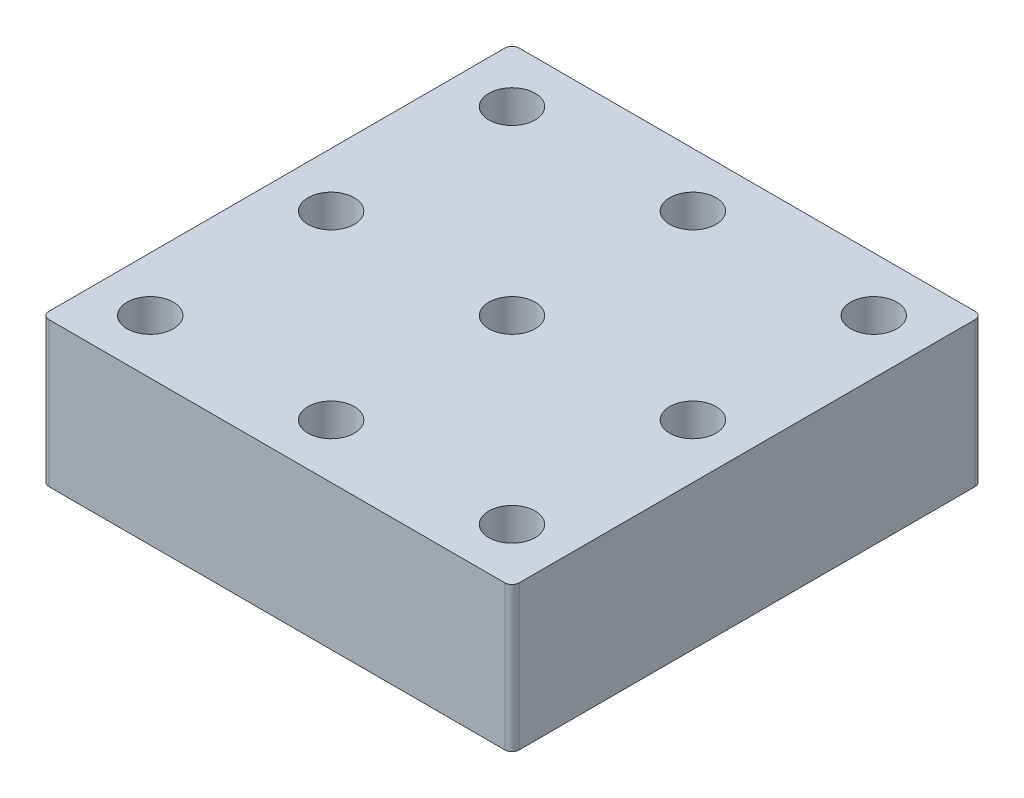
ISO-10303-21;
HEADER;
FILE_DESCRIPTION(('STEP AP214'),'2;1');
FILE_NAME('part.step','',(''),(''),'','','');
FILE_SCHEMA(('AUTOMOTIVE_DESIGN { 1 0 10303 214 1 1 1 1 }'));
ENDSEC;
DATA;
#1=APPLICATION_CONTEXT('core data for automotive mechanical design processes');
#2=APPLICATION_PROTOCOL_DEFINITION('international standard','automotive_design',2000,#1);
#3=PRODUCT_CONTEXT('',#1,'mechanical');
#4=PRODUCT('Part','Part','',(#3));
#5=PRODUCT_RELATED_PRODUCT_CATEGORY('part','',(#4));
#6=PRODUCT_DEFINITION_FORMATION('','',#4);
#7=PRODUCT_DEFINITION_CONTEXT('part definition',#1,'design');
#8=PRODUCT_DEFINITION('design','',#6,#7);
#9=PRODUCT_DEFINITION_SHAPE('','',#8);
#10=(LENGTH_UNIT() NAMED_UNIT(*) SI_UNIT(.MILLI.,.METRE.));
#11=(NAMED_UNIT(*) PLANE_ANGLE_UNIT() SI_UNIT($,.RADIAN.));
#12=(NAMED_UNIT(*) SI_UNIT($,.STERADIAN.) SOLID_ANGLE_UNIT());
#13=UNCERTAINTY_MEASURE_WITH_UNIT(LENGTH_MEASURE(1.E-05),#10,'distance_accuracy_value','');
#14=(GEOMETRIC_REPRESENTATION_CONTEXT(3) GLOBAL_UNCERTAINTY_ASSIGNED_CONTEXT((#13)) GLOBAL_UNIT_ASSIGNED_CONTEXT((#10,
#11,#12)) REPRESENTATION_CONTEXT('',''));
#15=CARTESIAN_POINT('',(0.,0.,0.));
#16=DIRECTION('',(0.,0.,1.));
#17=DIRECTION('',(1.,0.,0.));
#18=AXIS2_PLACEMENT_3D('',#15,#16,#17);
#19=CARTESIAN_POINT('',(-32.5,20.,-32.5));
#20=DIRECTION('',(1.,0.,0.));
#21=DIRECTION('',(0.,0.,-1.));
#22=AXIS2_PLACEMENT_3D('',#19,#20,#21);
#23=PLANE('',#22);
#24=DIRECTION('',(0.,0.,1.));
#25=VECTOR('',#24,1.);
#26=CARTESIAN_POINT('',(-32.5,20.,-32.5));
#27=LINE('',#26,#25);
#28=CARTESIAN_POINT('',(-32.5,20.,-31.5));
#29=VERTEX_POINT('',#28);
#30=CARTESIAN_POINT('',(-32.5,20.,31.5));
#31=VERTEX_POINT('',#30);
#32=EDGE_CURVE('E117',#29,#31,#27,.T.);
#33=ORIENTED_EDGE('',*,*,#32,.F.);
#34=DIRECTION('',(0.,-1.,0.));
#35=VECTOR('',#34,1.);
#36=CARTESIAN_POINT('',(-32.5,20.,-31.5));
#37=LINE('',#36,#35);
#38=CARTESIAN_POINT('',(-32.5,0.,-31.5));
#39=VERTEX_POINT('',#38);
#40=EDGE_CURVE('E102',#29,#39,#37,.T.);
#41=ORIENTED_EDGE('',*,*,#40,.T.);
#42=DIRECTION('',(0.,0.,1.));
#43=VECTOR('',#42,1.);
#44=CARTESIAN_POINT('',(-32.5,0.,-32.5));
#45=LINE('',#44,#43);
#46=CARTESIAN_POINT('',(-32.5,0.,31.5));
#47=VERTEX_POINT('',#46);
#48=EDGE_CURVE('E114',#39,#47,#45,.T.);
#49=ORIENTED_EDGE('',*,*,#48,.T.);
#50=DIRECTION('',(0.,-1.,0.));
#51=VECTOR('',#50,1.);
#52=CARTESIAN_POINT('',(-32.5,20.,31.5));
#53=LINE('',#52,#51);
#54=EDGE_CURVE('E119',#47,#31,#53,.F.);
#55=ORIENTED_EDGE('',*,*,#54,.T.);
#56=EDGE_LOOP('',(#33,#41,#49,#55));
#57=FACE_BOUND('',#56,.T.);
#58=ADVANCED_FACE('F32',(#57),#23,.F.);
#59=CARTESIAN_POINT('',(-32.5,20.,32.5));
#60=DIRECTION('',(0.,0.,-1.));
#61=DIRECTION('',(-1.,0.,0.));
#62=AXIS2_PLACEMENT_3D('',#59,#60,#61);
#63=PLANE('',#62);
#64=DIRECTION('',(1.,0.,0.));
#65=VECTOR('',#64,1.);
#66=CARTESIAN_POINT('',(-32.5,0.,32.5));
#67=LINE('',#66,#65);
#68=CARTESIAN_POINT('',(-31.5,0.,32.5));
#69=VERTEX_POINT('',#68);
#70=CARTESIAN_POINT('',(31.5,0.,32.5));
#71=VERTEX_POINT('',#70);
#72=EDGE_CURVE('E123',#69,#71,#67,.T.);
#73=ORIENTED_EDGE('',*,*,#72,.T.);
#74=DIRECTION('',(0.,-1.,0.));
#75=VECTOR('',#74,1.);
#76=CARTESIAN_POINT('',(31.5,20.,32.5));
#77=LINE('',#76,#75);
#78=CARTESIAN_POINT('',(31.5,20.,32.5));
#79=VERTEX_POINT('',#78);
#80=EDGE_CURVE('E11',#71,#79,#77,.F.);
#81=ORIENTED_EDGE('',*,*,#80,.T.);
#82=DIRECTION('',(1.,0.,0.));
#83=VECTOR('',#82,1.);
#84=CARTESIAN_POINT('',(-32.5,20.,32.5));
#85=LINE('',#84,#83);
#86=CARTESIAN_POINT('',(-31.5,20.,32.5));
#87=VERTEX_POINT('',#86);
#88=EDGE_CURVE('E163',#87,#79,#85,.T.);
#89=ORIENTED_EDGE('',*,*,#88,.F.);
#90=DIRECTION('',(0.,-1.,0.));
#91=VECTOR('',#90,1.);
#92=CARTESIAN_POINT('',(-31.5,20.,32.5));
#93=LINE('',#92,#91);
#94=EDGE_CURVE('E40',#87,#69,#93,.T.);
#95=ORIENTED_EDGE('',*,*,#94,.T.);
#96=EDGE_LOOP('',(#73,#81,#89,#95));
#97=FACE_BOUND('',#96,.T.);
#98=ADVANCED_FACE('F161',(#97),#63,.F.);
#99=CARTESIAN_POINT('',(32.5,20.,-32.5));
#100=DIRECTION('',(-1.,0.,0.));
#101=DIRECTION('',(0.,0.,1.));
#102=AXIS2_PLACEMENT_3D('',#99,#100,#101);
#103=PLANE('',#102);
#104=DIRECTION('',(0.,0.,-1.));
#105=VECTOR('',#104,1.);
#106=CARTESIAN_POINT('',(32.5,0.,-32.5));
#107=LINE('',#106,#105);
#108=CARTESIAN_POINT('',(32.5,0.,31.5));
#109=VERTEX_POINT('',#108);
#110=CARTESIAN_POINT('',(32.5,0.,-31.5));
#111=VERTEX_POINT('',#110);
#112=EDGE_CURVE('E127',#109,#111,#107,.T.);
#113=ORIENTED_EDGE('',*,*,#112,.T.);
#114=DIRECTION('',(0.,-1.,0.));
#115=VECTOR('',#114,1.);
#116=CARTESIAN_POINT('',(32.5,20.,-31.5));
#117=LINE('',#116,#115);
#118=CARTESIAN_POINT('',(32.5,20.,-31.5));
#119=VERTEX_POINT('',#118);
#120=EDGE_CURVE('E47',#111,#119,#117,.F.);
#121=ORIENTED_EDGE('',*,*,#120,.T.);
#122=DIRECTION('',(0.,0.,-1.));
#123=VECTOR('',#122,1.);
#124=CARTESIAN_POINT('',(32.5,20.,-32.5));
#125=LINE('',#124,#123);
#126=CARTESIAN_POINT('',(32.5,20.,31.5));
#127=VERTEX_POINT('',#126);
#128=EDGE_CURVE('E171',#127,#119,#125,.T.);
#129=ORIENTED_EDGE('',*,*,#128,.F.);
#130=DIRECTION('',(0.,-1.,0.));
#131=VECTOR('',#130,1.);
#132=CARTESIAN_POINT('',(32.5,20.,31.5));
#133=LINE('',#132,#131);
#134=EDGE_CURVE('E154',#127,#109,#133,.T.);
#135=ORIENTED_EDGE('',*,*,#134,.T.);
#136=EDGE_LOOP('',(#113,#121,#129,#135));
#137=FACE_BOUND('',#136,.T.);
#138=ADVANCED_FACE('F170',(#137),#103,.F.);
#139=CARTESIAN_POINT('',(-32.5,20.,-32.5));
#140=DIRECTION('',(0.,0.,1.));
#141=DIRECTION('',(1.,0.,0.));
#142=AXIS2_PLACEMENT_3D('',#139,#140,#141);
#143=PLANE('',#142);
#144=DIRECTION('',(-1.,0.,0.));
#145=VECTOR('',#144,1.);
#146=CARTESIAN_POINT('',(-32.5,0.,-32.5));
#147=LINE('',#146,#145);
#148=CARTESIAN_POINT('',(31.5,0.,-32.5));
#149=VERTEX_POINT('',#148);
#150=CARTESIAN_POINT('',(-31.5,0.,-32.5));
#151=VERTEX_POINT('',#150);
#152=EDGE_CURVE('E137',#149,#151,#147,.T.);
#153=ORIENTED_EDGE('',*,*,#152,.T.);
#154=DIRECTION('',(0.,-1.,0.));
#155=VECTOR('',#154,1.);
#156=CARTESIAN_POINT('',(-31.5,20.,-32.5));
#157=LINE('',#156,#155);
#158=CARTESIAN_POINT('',(-31.5,20.,-32.5));
#159=VERTEX_POINT('',#158);
#160=EDGE_CURVE('E103',#151,#159,#157,.F.);
#161=ORIENTED_EDGE('',*,*,#160,.T.);
#162=DIRECTION('',(-1.,0.,0.));
#163=VECTOR('',#162,1.);
#164=CARTESIAN_POINT('',(-32.5,20.,-32.5));
#165=LINE('',#164,#163);
#166=CARTESIAN_POINT('',(31.5,20.,-32.5));
#167=VERTEX_POINT('',#166);
#168=EDGE_CURVE('E133',#167,#159,#165,.T.);
#169=ORIENTED_EDGE('',*,*,#168,.F.);
#170=DIRECTION('',(0.,-1.,0.));
#171=VECTOR('',#170,1.);
#172=CARTESIAN_POINT('',(31.5,20.,-32.5));
#173=LINE('',#172,#171);
#174=EDGE_CURVE('E108',#167,#149,#173,.T.);
#175=ORIENTED_EDGE('',*,*,#174,.T.);
#176=EDGE_LOOP('',(#153,#161,#169,#175));
#177=FACE_BOUND('',#176,.T.);
#178=ADVANCED_FACE('F264',(#177),#143,.F.);
#179=CARTESIAN_POINT('',(0.,20.,0.));
#180=DIRECTION('',(0.,1.,0.));
#181=DIRECTION('',(0.,0.,1.));
#182=AXIS2_PLACEMENT_3D('',#179,#180,#181);
#183=PLANE('',#182);
#184=CARTESIAN_POINT('',(0.,20.,0.));
#185=DIRECTION('',(0.,1.,0.));
#186=DIRECTION('',(0.,0.,1.));
#187=AXIS2_PLACEMENT_3D('',#184,#185,#186);
#188=CIRCLE('',#187,3.2);
#189=CARTESIAN_POINT('',(0.,20.,3.2));
#190=VERTEX_POINT('',#189);
#191=EDGE_CURVE('E228',#190,#190,#188,.T.);
#192=ORIENTED_EDGE('',*,*,#191,.F.);
#193=EDGE_LOOP('',(#192));
#194=FACE_BOUND('',#193,.T.);
#195=CARTESIAN_POINT('',(-25.,20.,0.));
#196=DIRECTION('',(0.,1.,0.));
#197=DIRECTION('',(0.,0.,1.));
#198=AXIS2_PLACEMENT_3D('',#195,#196,#197);
#199=CIRCLE('',#198,3.2);
#200=CARTESIAN_POINT('',(-25.,20.,3.2));
#201=VERTEX_POINT('',#200);
#202=EDGE_CURVE('E234',#201,#201,#199,.T.);
#203=ORIENTED_EDGE('',*,*,#202,.F.);
#204=EDGE_LOOP('',(#203));
#205=FACE_BOUND('',#204,.T.);
#206=CARTESIAN_POINT('',(-25.,20.,25.));
#207=DIRECTION('',(0.,1.,0.));
#208=DIRECTION('',(0.,0.,1.));
#209=AXIS2_PLACEMENT_3D('',#206,#207,#208);
#210=CIRCLE('',#209,3.2);
#211=CARTESIAN_POINT('',(-25.,20.,28.2));
#212=VERTEX_POINT('',#211);
#213=EDGE_CURVE('E240',#212,#212,#210,.T.);
#214=ORIENTED_EDGE('',*,*,#213,.F.);
#215=EDGE_LOOP('',(#214));
#216=FACE_BOUND('',#215,.T.);
#217=CARTESIAN_POINT('',(0.,20.,25.));
#218=DIRECTION('',(0.,1.,0.));
#219=DIRECTION('',(0.,0.,1.));
#220=AXIS2_PLACEMENT_3D('',#217,#218,#219);
#221=CIRCLE('',#220,3.2);
#222=CARTESIAN_POINT('',(0.,20.,28.2));
#223=VERTEX_POINT('',#222);
#224=EDGE_CURVE('E246',#223,#223,#221,.T.);
#225=ORIENTED_EDGE('',*,*,#224,.F.);
#226=EDGE_LOOP('',(#225));
#227=FACE_BOUND('',#226,.T.);
#228=CARTESIAN_POINT('',(25.,20.,25.));
#229=DIRECTION('',(0.,1.,0.));
#230=DIRECTION('',(0.,0.,1.));
#231=AXIS2_PLACEMENT_3D('',#228,#229,#230);
#232=CIRCLE('',#231,3.2);
#233=CARTESIAN_POINT('',(25.,20.,28.2));
#234=VERTEX_POINT('',#233);
#235=EDGE_CURVE('E204',#234,#234,#232,.T.);
#236=ORIENTED_EDGE('',*,*,#235,.F.);
#237=EDGE_LOOP('',(#236));
#238=FACE_BOUND('',#237,.T.);
#239=CARTESIAN_POINT('',(25.,20.,0.));
#240=DIRECTION('',(0.,1.,0.));
#241=DIRECTION('',(0.,0.,1.));
#242=AXIS2_PLACEMENT_3D('',#239,#240,#241);
#243=CIRCLE('',#242,3.2);
#244=CARTESIAN_POINT('',(25.,20.,3.2));
#245=VERTEX_POINT('',#244);
#246=EDGE_CURVE('E211',#245,#245,#243,.T.);
#247=ORIENTED_EDGE('',*,*,#246,.F.);
#248=EDGE_LOOP('',(#247));
#249=FACE_BOUND('',#248,.T.);
#250=CARTESIAN_POINT('',(25.,20.,-25.));
#251=DIRECTION('',(0.,1.,0.));
#252=DIRECTION('',(0.,0.,1.));
#253=AXIS2_PLACEMENT_3D('',#250,#251,#252);
#254=CIRCLE('',#253,3.2);
#255=CARTESIAN_POINT('',(25.,20.,-21.8));
#256=VERTEX_POINT('',#255);
#257=EDGE_CURVE('E217',#256,#256,#254,.T.);
#258=ORIENTED_EDGE('',*,*,#257,.F.);
#259=EDGE_LOOP('',(#258));
#260=FACE_BOUND('',#259,.T.);
#261=CARTESIAN_POINT('',(0.,20.,-25.));
#262=DIRECTION('',(0.,1.,0.));
#263=DIRECTION('',(0.,0.,1.));
#264=AXIS2_PLACEMENT_3D('',#261,#262,#263);
#265=CIRCLE('',#264,3.2);
#266=CARTESIAN_POINT('',(0.,20.,-21.8));
#267=VERTEX_POINT('',#266);
#268=EDGE_CURVE('E223',#267,#267,#265,.T.);
#269=ORIENTED_EDGE('',*,*,#268,.F.);
#270=EDGE_LOOP('',(#269));
#271=FACE_BOUND('',#270,.T.);
#272=CARTESIAN_POINT('',(-25.,20.,-25.));
#273=DIRECTION('',(0.,1.,0.));
#274=DIRECTION('',(0.,0.,1.));
#275=AXIS2_PLACEMENT_3D('',#272,#273,#274);
#276=CIRCLE('',#275,3.2);
#277=CARTESIAN_POINT('',(-25.,20.,-21.8));
#278=VERTEX_POINT('',#277);
#279=EDGE_CURVE('E198',#278,#278,#276,.T.);
#280=ORIENTED_EDGE('',*,*,#279,.F.);
#281=EDGE_LOOP('',(#280));
#282=FACE_BOUND('',#281,.T.);
#283=ORIENTED_EDGE('',*,*,#168,.T.);
#284=CARTESIAN_POINT('',(-31.5,20.,-31.5));
#285=DIRECTION('',(0.,1.,0.));
#286=DIRECTION('',(0.,0.,1.));
#287=AXIS2_PLACEMENT_3D('',#284,#285,#286);
#288=CIRCLE('',#287,1.);
#289=EDGE_CURVE('E152',#159,#29,#288,.T.);
#290=ORIENTED_EDGE('',*,*,#289,.T.);
#291=ORIENTED_EDGE('',*,*,#32,.T.);
#292=CARTESIAN_POINT('',(-31.5,20.,31.5));
#293=DIRECTION('',(0.,1.,0.));
#294=DIRECTION('',(0.,0.,1.));
#295=AXIS2_PLACEMENT_3D('',#292,#293,#294);
#296=CIRCLE('',#295,1.);
#297=EDGE_CURVE('E147',#31,#87,#296,.T.);
#298=ORIENTED_EDGE('',*,*,#297,.T.);
#299=ORIENTED_EDGE('',*,*,#88,.T.);
#300=CARTESIAN_POINT('',(31.5,20.,31.5));
#301=DIRECTION('',(0.,1.,0.));
#302=DIRECTION('',(0.,0.,1.));
#303=AXIS2_PLACEMENT_3D('',#300,#301,#302);
#304=CIRCLE('',#303,1.);
#305=EDGE_CURVE('E54',#79,#127,#304,.T.);
#306=ORIENTED_EDGE('',*,*,#305,.T.);
#307=ORIENTED_EDGE('',*,*,#128,.T.);
#308=CARTESIAN_POINT('',(31.5,20.,-31.5));
#309=DIRECTION('',(0.,1.,0.));
#310=DIRECTION('',(0.,0.,1.));
#311=AXIS2_PLACEMENT_3D('',#308,#309,#310);
#312=CIRCLE('',#311,1.);
#313=EDGE_CURVE('E150',#119,#167,#312,.T.);
#314=ORIENTED_EDGE('',*,*,#313,.T.);
#315=EDGE_LOOP('',(#283,#290,#291,#298,#299,#306,#307,#314));
#316=FACE_BOUND('',#315,.T.);
#317=ADVANCED_FACE('F261',(#194,#205,#216,#227,#238,#249,#260,#271,#282,#316),#183,.T.);
#318=CARTESIAN_POINT('',(0.,0.,0.));
#319=DIRECTION('',(0.,1.,0.));
#320=DIRECTION('',(0.,0.,1.));
#321=AXIS2_PLACEMENT_3D('',#318,#319,#320);
#322=PLANE('',#321);
#323=CARTESIAN_POINT('',(25.,0.,25.));
#324=DIRECTION('',(0.,-1.,0.));
#325=DIRECTION('',(0.,0.,-1.));
#326=AXIS2_PLACEMENT_3D('',#323,#324,#325);
#327=CIRCLE('',#326,3.);
#328=CARTESIAN_POINT('',(25.,0.,22.));
#329=VERTEX_POINT('',#328);
#330=EDGE_CURVE('E193',#329,#329,#327,.T.);
#331=ORIENTED_EDGE('',*,*,#330,.F.);
#332=EDGE_LOOP('',(#331));
#333=FACE_BOUND('',#332,.T.);
#334=CARTESIAN_POINT('',(25.,0.,-25.));
#335=DIRECTION('',(0.,-1.,0.));
#336=DIRECTION('',(0.,0.,-1.));
#337=AXIS2_PLACEMENT_3D('',#334,#335,#336);
#338=CIRCLE('',#337,3.);
#339=CARTESIAN_POINT('',(25.,0.,-28.));
#340=VERTEX_POINT('',#339);
#341=EDGE_CURVE('E187',#340,#340,#338,.T.);
#342=ORIENTED_EDGE('',*,*,#341,.F.);
#343=EDGE_LOOP('',(#342));
#344=FACE_BOUND('',#343,.T.);
#345=CARTESIAN_POINT('',(-25.,0.,-25.));
#346=DIRECTION('',(0.,-1.,0.));
#347=DIRECTION('',(0.,0.,-1.));
#348=AXIS2_PLACEMENT_3D('',#345,#346,#347);
#349=CIRCLE('',#348,3.);
#350=CARTESIAN_POINT('',(-25.,0.,-28.));
#351=VERTEX_POINT('',#350);
#352=EDGE_CURVE('E180',#351,#351,#349,.T.);
#353=ORIENTED_EDGE('',*,*,#352,.F.);
#354=EDGE_LOOP('',(#353));
#355=FACE_BOUND('',#354,.T.);
#356=CARTESIAN_POINT('',(-25.,0.,25.));
#357=DIRECTION('',(0.,-1.,0.));
#358=DIRECTION('',(0.,0.,-1.));
#359=AXIS2_PLACEMENT_3D('',#356,#357,#358);
#360=CIRCLE('',#359,3.);
#361=CARTESIAN_POINT('',(-25.,0.,22.));
#362=VERTEX_POINT('',#361);
#363=EDGE_CURVE('E130',#362,#362,#360,.T.);
#364=ORIENTED_EDGE('',*,*,#363,.F.);
#365=EDGE_LOOP('',(#364));
#366=FACE_BOUND('',#365,.T.);
#367=ORIENTED_EDGE('',*,*,#48,.F.);
#368=CARTESIAN_POINT('',(-31.5,0.,-31.5));
#369=DIRECTION('',(0.,1.,0.));
#370=DIRECTION('',(0.,0.,1.));
#371=AXIS2_PLACEMENT_3D('',#368,#369,#370);
#372=CIRCLE('',#371,1.);
#373=EDGE_CURVE('E98',#39,#151,#372,.F.);
#374=ORIENTED_EDGE('',*,*,#373,.T.);
#375=ORIENTED_EDGE('',*,*,#152,.F.);
#376=CARTESIAN_POINT('',(31.5,0.,-31.5));
#377=DIRECTION('',(0.,1.,0.));
#378=DIRECTION('',(0.,0.,1.));
#379=AXIS2_PLACEMENT_3D('',#376,#377,#378);
#380=CIRCLE('',#379,1.);
#381=EDGE_CURVE('E109',#149,#111,#380,.F.);
#382=ORIENTED_EDGE('',*,*,#381,.T.);
#383=ORIENTED_EDGE('',*,*,#112,.F.);
#384=CARTESIAN_POINT('',(31.5,0.,31.5));
#385=DIRECTION('',(0.,1.,0.));
#386=DIRECTION('',(0.,0.,1.));
#387=AXIS2_PLACEMENT_3D('',#384,#385,#386);
#388=CIRCLE('',#387,1.);
#389=EDGE_CURVE('E141',#109,#71,#388,.F.);
#390=ORIENTED_EDGE('',*,*,#389,.T.);
#391=ORIENTED_EDGE('',*,*,#72,.F.);
#392=CARTESIAN_POINT('',(-31.5,0.,31.5));
#393=DIRECTION('',(0.,1.,0.));
#394=DIRECTION('',(0.,0.,1.));
#395=AXIS2_PLACEMENT_3D('',#392,#393,#394);
#396=CIRCLE('',#395,1.);
#397=EDGE_CURVE('E118',#69,#47,#396,.F.);
#398=ORIENTED_EDGE('',*,*,#397,.T.);
#399=EDGE_LOOP('',(#367,#374,#375,#382,#383,#390,#391,#398));
#400=FACE_BOUND('',#399,.T.);
#401=ADVANCED_FACE('F121',(#333,#344,#355,#366,#400),#322,.F.);
#402=CARTESIAN_POINT('',(-25.,7.5,25.));
#403=DIRECTION('',(0.,-1.,0.));
#404=DIRECTION('',(0.,0.,-1.));
#405=AXIS2_PLACEMENT_3D('',#402,#403,#404);
#406=CYLINDRICAL_SURFACE('',#405,3.);
#407=CARTESIAN_POINT('',(-25.,7.5,25.));
#408=DIRECTION('',(0.,-1.,0.));
#409=DIRECTION('',(0.,0.,-1.));
#410=AXIS2_PLACEMENT_3D('',#407,#408,#409);
#411=CIRCLE('',#410,3.);
#412=CARTESIAN_POINT('',(-25.,7.5,22.));
#413=VERTEX_POINT('',#412);
#414=EDGE_CURVE('E124',#413,#413,#411,.T.);
#415=ORIENTED_EDGE('',*,*,#414,.F.);
#416=EDGE_LOOP('',(#415));
#417=FACE_BOUND('',#416,.T.);
#418=ORIENTED_EDGE('',*,*,#363,.T.);
#419=EDGE_LOOP('',(#418));
#420=FACE_BOUND('',#419,.T.);
#421=ADVANCED_FACE('F301',(#417,#420),#406,.F.);
#422=CARTESIAN_POINT('',(-25.,7.5,25.));
#423=DIRECTION('',(0.,-1.,0.));
#424=DIRECTION('',(0.,0.,-1.));
#425=AXIS2_PLACEMENT_3D('',#422,#423,#424);
#426=PLANE('',#425);
#427=ORIENTED_EDGE('',*,*,#414,.T.);
#428=EDGE_LOOP('',(#427));
#429=FACE_BOUND('',#428,.T.);
#430=ADVANCED_FACE('F306',(#429),#426,.T.);
#431=CARTESIAN_POINT('',(-25.,7.5,-25.));
#432=DIRECTION('',(0.,-1.,0.));
#433=DIRECTION('',(0.,0.,-1.));
#434=AXIS2_PLACEMENT_3D('',#431,#432,#433);
#435=CYLINDRICAL_SURFACE('',#434,3.);
#436=CARTESIAN_POINT('',(-25.,7.5,-25.));
#437=DIRECTION('',(0.,-1.,0.));
#438=DIRECTION('',(0.,0.,-1.));
#439=AXIS2_PLACEMENT_3D('',#436,#437,#438);
#440=CIRCLE('',#439,3.);
#441=CARTESIAN_POINT('',(-25.,7.5,-28.));
#442=VERTEX_POINT('',#441);
#443=EDGE_CURVE('E183',#442,#442,#440,.T.);
#444=ORIENTED_EDGE('',*,*,#443,.F.);
#445=EDGE_LOOP('',(#444));
#446=FACE_BOUND('',#445,.T.);
#447=ORIENTED_EDGE('',*,*,#352,.T.);
#448=EDGE_LOOP('',(#447));
#449=FACE_BOUND('',#448,.T.);
#450=ADVANCED_FACE('F310',(#446,#449),#435,.F.);
#451=CARTESIAN_POINT('',(-25.,7.5,-25.));
#452=DIRECTION('',(0.,-1.,0.));
#453=DIRECTION('',(0.,0.,-1.));
#454=AXIS2_PLACEMENT_3D('',#451,#452,#453);
#455=PLANE('',#454);
#456=ORIENTED_EDGE('',*,*,#443,.T.);
#457=EDGE_LOOP('',(#456));
#458=FACE_BOUND('',#457,.T.);
#459=ADVANCED_FACE('F314',(#458),#455,.T.);
#460=CARTESIAN_POINT('',(25.,7.5,-25.));
#461=DIRECTION('',(0.,-1.,0.));
#462=DIRECTION('',(0.,0.,-1.));
#463=AXIS2_PLACEMENT_3D('',#460,#461,#462);
#464=CYLINDRICAL_SURFACE('',#463,3.);
#465=CARTESIAN_POINT('',(25.,7.5,-25.));
#466=DIRECTION('',(0.,-1.,0.));
#467=DIRECTION('',(0.,0.,-1.));
#468=AXIS2_PLACEMENT_3D('',#465,#466,#467);
#469=CIRCLE('',#468,3.);
#470=CARTESIAN_POINT('',(25.,7.5,-28.));
#471=VERTEX_POINT('',#470);
#472=EDGE_CURVE('E190',#471,#471,#469,.T.);
#473=ORIENTED_EDGE('',*,*,#472,.F.);
#474=EDGE_LOOP('',(#473));
#475=FACE_BOUND('',#474,.T.);
#476=ORIENTED_EDGE('',*,*,#341,.T.);
#477=EDGE_LOOP('',(#476));
#478=FACE_BOUND('',#477,.T.);
#479=ADVANCED_FACE('F318',(#475,#478),#464,.F.);
#480=CARTESIAN_POINT('',(25.,7.5,-25.));
#481=DIRECTION('',(0.,-1.,0.));
#482=DIRECTION('',(0.,0.,-1.));
#483=AXIS2_PLACEMENT_3D('',#480,#481,#482);
#484=PLANE('',#483);
#485=ORIENTED_EDGE('',*,*,#472,.T.);
#486=EDGE_LOOP('',(#485));
#487=FACE_BOUND('',#486,.T.);
#488=ADVANCED_FACE('F322',(#487),#484,.T.);
#489=CARTESIAN_POINT('',(25.,7.5,25.));
#490=DIRECTION('',(0.,-1.,0.));
#491=DIRECTION('',(0.,0.,-1.));
#492=AXIS2_PLACEMENT_3D('',#489,#490,#491);
#493=CYLINDRICAL_SURFACE('',#492,3.);
#494=CARTESIAN_POINT('',(25.,7.5,25.));
#495=DIRECTION('',(0.,-1.,0.));
#496=DIRECTION('',(0.,0.,-1.));
#497=AXIS2_PLACEMENT_3D('',#494,#495,#496);
#498=CIRCLE('',#497,3.);
#499=CARTESIAN_POINT('',(25.,7.5,22.));
#500=VERTEX_POINT('',#499);
#501=EDGE_CURVE('E178',#500,#500,#498,.T.);
#502=ORIENTED_EDGE('',*,*,#501,.F.);
#503=EDGE_LOOP('',(#502));
#504=FACE_BOUND('',#503,.T.);
#505=ORIENTED_EDGE('',*,*,#330,.T.);
#506=EDGE_LOOP('',(#505));
#507=FACE_BOUND('',#506,.T.);
#508=ADVANCED_FACE('F326',(#504,#507),#493,.F.);
#509=CARTESIAN_POINT('',(25.,7.5,25.));
#510=DIRECTION('',(0.,-1.,0.));
#511=DIRECTION('',(0.,0.,-1.));
#512=AXIS2_PLACEMENT_3D('',#509,#510,#511);
#513=PLANE('',#512);
#514=ORIENTED_EDGE('',*,*,#501,.T.);
#515=EDGE_LOOP('',(#514));
#516=FACE_BOUND('',#515,.T.);
#517=ADVANCED_FACE('F330',(#516),#513,.T.);
#518=CARTESIAN_POINT('',(-25.,12.5,-25.));
#519=DIRECTION('',(0.,1.,0.));
#520=DIRECTION('',(0.,0.,1.));
#521=AXIS2_PLACEMENT_3D('',#518,#519,#520);
#522=CYLINDRICAL_SURFACE('',#521,3.2);
#523=CARTESIAN_POINT('',(-25.,12.5,-25.));
#524=DIRECTION('',(0.,1.,0.));
#525=DIRECTION('',(0.,0.,1.));
#526=AXIS2_PLACEMENT_3D('',#523,#524,#525);
#527=CIRCLE('',#526,3.2);
#528=CARTESIAN_POINT('',(-25.,12.5,-21.8));
#529=VERTEX_POINT('',#528);
#530=EDGE_CURVE('E184',#529,#529,#527,.T.);
#531=ORIENTED_EDGE('',*,*,#530,.F.);
#532=EDGE_LOOP('',(#531));
#533=FACE_BOUND('',#532,.T.);
#534=ORIENTED_EDGE('',*,*,#279,.T.);
#535=EDGE_LOOP('',(#534));
#536=FACE_BOUND('',#535,.T.);
#537=ADVANCED_FACE('F334',(#533,#536),#522,.F.);
#538=CARTESIAN_POINT('',(-25.,12.5,-25.));
#539=DIRECTION('',(0.,1.,0.));
#540=DIRECTION('',(0.,0.,1.));
#541=AXIS2_PLACEMENT_3D('',#538,#539,#540);
#542=PLANE('',#541);
#543=ORIENTED_EDGE('',*,*,#530,.T.);
#544=EDGE_LOOP('',(#543));
#545=FACE_BOUND('',#544,.T.);
#546=ADVANCED_FACE('F338',(#545),#542,.T.);
#547=CARTESIAN_POINT('',(0.,12.5,-25.));
#548=DIRECTION('',(0.,1.,0.));
#549=DIRECTION('',(0.,0.,1.));
#550=AXIS2_PLACEMENT_3D('',#547,#548,#549);
#551=CYLINDRICAL_SURFACE('',#550,3.2);
#552=CARTESIAN_POINT('',(0.,12.5,-25.));
#553=DIRECTION('',(0.,1.,0.));
#554=DIRECTION('',(0.,0.,1.));
#555=AXIS2_PLACEMENT_3D('',#552,#553,#554);
#556=CIRCLE('',#555,3.2);
#557=CARTESIAN_POINT('',(0.,12.5,-21.8));
#558=VERTEX_POINT('',#557);
#559=EDGE_CURVE('E201',#558,#558,#556,.T.);
#560=ORIENTED_EDGE('',*,*,#559,.F.);
#561=EDGE_LOOP('',(#560));
#562=FACE_BOUND('',#561,.T.);
#563=ORIENTED_EDGE('',*,*,#268,.T.);
#564=EDGE_LOOP('',(#563));
#565=FACE_BOUND('',#564,.T.);
#566=ADVANCED_FACE('F342',(#562,#565),#551,.F.);
#567=CARTESIAN_POINT('',(0.,12.5,-25.));
#568=DIRECTION('',(0.,1.,0.));
#569=DIRECTION('',(0.,0.,1.));
#570=AXIS2_PLACEMENT_3D('',#567,#568,#569);
#571=PLANE('',#570);
#572=ORIENTED_EDGE('',*,*,#559,.T.);
#573=EDGE_LOOP('',(#572));
#574=FACE_BOUND('',#573,.T.);
#575=ADVANCED_FACE('F363',(#574),#571,.T.);
#576=CARTESIAN_POINT('',(25.,12.5,-25.));
#577=DIRECTION('',(0.,1.,0.));
#578=DIRECTION('',(0.,0.,1.));
#579=AXIS2_PLACEMENT_3D('',#576,#577,#578);
#580=CYLINDRICAL_SURFACE('',#579,3.2);
#581=CARTESIAN_POINT('',(25.,12.5,-25.));
#582=DIRECTION('',(0.,1.,0.));
#583=DIRECTION('',(0.,0.,1.));
#584=AXIS2_PLACEMENT_3D('',#581,#582,#583);
#585=CIRCLE('',#584,3.2);
#586=CARTESIAN_POINT('',(25.,12.5,-21.8));
#587=VERTEX_POINT('',#586);
#588=EDGE_CURVE('E220',#587,#587,#585,.T.);
#589=ORIENTED_EDGE('',*,*,#588,.F.);
#590=EDGE_LOOP('',(#589));
#591=FACE_BOUND('',#590,.T.);
#592=ORIENTED_EDGE('',*,*,#257,.T.);
#593=EDGE_LOOP('',(#592));
#594=FACE_BOUND('',#593,.T.);
#595=ADVANCED_FACE('F360',(#591,#594),#580,.F.);
#596=CARTESIAN_POINT('',(25.,12.5,-25.));
#597=DIRECTION('',(0.,1.,0.));
#598=DIRECTION('',(0.,0.,1.));
#599=AXIS2_PLACEMENT_3D('',#596,#597,#598);
#600=PLANE('',#599);
#601=ORIENTED_EDGE('',*,*,#588,.T.);
#602=EDGE_LOOP('',(#601));
#603=FACE_BOUND('',#602,.T.);
#604=ADVANCED_FACE('F355',(#603),#600,.T.);
#605=CARTESIAN_POINT('',(25.,12.5,0.));
#606=DIRECTION('',(0.,1.,0.));
#607=DIRECTION('',(0.,0.,1.));
#608=AXIS2_PLACEMENT_3D('',#605,#606,#607);
#609=CYLINDRICAL_SURFACE('',#608,3.2);
#610=CARTESIAN_POINT('',(25.,12.5,0.));
#611=DIRECTION('',(0.,1.,0.));
#612=DIRECTION('',(0.,0.,1.));
#613=AXIS2_PLACEMENT_3D('',#610,#611,#612);
#614=CIRCLE('',#613,3.2);
#615=CARTESIAN_POINT('',(25.,12.5,3.2));
#616=VERTEX_POINT('',#615);
#617=EDGE_CURVE('E214',#616,#616,#614,.T.);
#618=ORIENTED_EDGE('',*,*,#617,.F.);
#619=EDGE_LOOP('',(#618));
#620=FACE_BOUND('',#619,.T.);
#621=ORIENTED_EDGE('',*,*,#246,.T.);
#622=EDGE_LOOP('',(#621));
#623=FACE_BOUND('',#622,.T.);
#624=ADVANCED_FACE('F352',(#620,#623),#609,.F.);
#625=CARTESIAN_POINT('',(25.,12.5,0.));
#626=DIRECTION('',(0.,1.,0.));
#627=DIRECTION('',(0.,0.,1.));
#628=AXIS2_PLACEMENT_3D('',#625,#626,#627);
#629=PLANE('',#628);
#630=ORIENTED_EDGE('',*,*,#617,.T.);
#631=EDGE_LOOP('',(#630));
#632=FACE_BOUND('',#631,.T.);
#633=ADVANCED_FACE('F347',(#632),#629,.T.);
#634=CARTESIAN_POINT('',(25.,12.5,25.));
#635=DIRECTION('',(0.,1.,0.));
#636=DIRECTION('',(0.,0.,1.));
#637=AXIS2_PLACEMENT_3D('',#634,#635,#636);
#638=CYLINDRICAL_SURFACE('',#637,3.2);
#639=CARTESIAN_POINT('',(25.,12.5,25.));
#640=DIRECTION('',(0.,1.,0.));
#641=DIRECTION('',(0.,0.,1.));
#642=AXIS2_PLACEMENT_3D('',#639,#640,#641);
#643=CIRCLE('',#642,3.2);
#644=CARTESIAN_POINT('',(25.,12.5,28.2));
#645=VERTEX_POINT('',#644);
#646=EDGE_CURVE('E207',#645,#645,#643,.T.);
#647=ORIENTED_EDGE('',*,*,#646,.F.);
#648=EDGE_LOOP('',(#647));
#649=FACE_BOUND('',#648,.T.);
#650=ORIENTED_EDGE('',*,*,#235,.T.);
#651=EDGE_LOOP('',(#650));
#652=FACE_BOUND('',#651,.T.);
#653=ADVANCED_FACE('F344',(#649,#652),#638,.F.);
#654=CARTESIAN_POINT('',(25.,12.5,25.));
#655=DIRECTION('',(0.,1.,0.));
#656=DIRECTION('',(0.,0.,1.));
#657=AXIS2_PLACEMENT_3D('',#654,#655,#656);
#658=PLANE('',#657);
#659=ORIENTED_EDGE('',*,*,#646,.T.);
#660=EDGE_LOOP('',(#659));
#661=FACE_BOUND('',#660,.T.);
#662=ADVANCED_FACE('F257',(#661),#658,.T.);
#663=CARTESIAN_POINT('',(0.,12.5,25.));
#664=DIRECTION('',(0.,1.,0.));
#665=DIRECTION('',(0.,0.,1.));
#666=AXIS2_PLACEMENT_3D('',#663,#664,#665);
#667=CYLINDRICAL_SURFACE('',#666,3.2);
#668=CARTESIAN_POINT('',(0.,12.5,25.));
#669=DIRECTION('',(0.,1.,0.));
#670=DIRECTION('',(0.,0.,1.));
#671=AXIS2_PLACEMENT_3D('',#668,#669,#670);
#672=CIRCLE('',#671,3.2);
#673=CARTESIAN_POINT('',(0.,12.5,28.2));
#674=VERTEX_POINT('',#673);
#675=EDGE_CURVE('E208',#674,#674,#672,.T.);
#676=ORIENTED_EDGE('',*,*,#675,.F.);
#677=EDGE_LOOP('',(#676));
#678=FACE_BOUND('',#677,.T.);
#679=ORIENTED_EDGE('',*,*,#224,.T.);
#680=EDGE_LOOP('',(#679));
#681=FACE_BOUND('',#680,.T.);
#682=ADVANCED_FACE('F254',(#678,#681),#667,.F.);
#683=CARTESIAN_POINT('',(0.,12.5,25.));
#684=DIRECTION('',(0.,1.,0.));
#685=DIRECTION('',(0.,0.,1.));
#686=AXIS2_PLACEMENT_3D('',#683,#684,#685);
#687=PLANE('',#686);
#688=ORIENTED_EDGE('',*,*,#675,.T.);
#689=EDGE_LOOP('',(#688));
#690=FACE_BOUND('',#689,.T.);
#691=ADVANCED_FACE('F252',(#690),#687,.T.);
#692=CARTESIAN_POINT('',(-25.,12.5,25.));
#693=DIRECTION('',(0.,1.,0.));
#694=DIRECTION('',(0.,0.,1.));
#695=AXIS2_PLACEMENT_3D('',#692,#693,#694);
#696=CYLINDRICAL_SURFACE('',#695,3.2);
#697=CARTESIAN_POINT('',(-25.,12.5,25.));
#698=DIRECTION('',(0.,1.,0.));
#699=DIRECTION('',(0.,0.,1.));
#700=AXIS2_PLACEMENT_3D('',#697,#698,#699);
#701=CIRCLE('',#700,3.2);
#702=CARTESIAN_POINT('',(-25.,12.5,28.2));
#703=VERTEX_POINT('',#702);
#704=EDGE_CURVE('E243',#703,#703,#701,.T.);
#705=ORIENTED_EDGE('',*,*,#704,.F.);
#706=EDGE_LOOP('',(#705));
#707=FACE_BOUND('',#706,.T.);
#708=ORIENTED_EDGE('',*,*,#213,.T.);
#709=EDGE_LOOP('',(#708));
#710=FACE_BOUND('',#709,.T.);
#711=ADVANCED_FACE('F390',(#707,#710),#696,.F.);
#712=CARTESIAN_POINT('',(-25.,12.5,25.));
#713=DIRECTION('',(0.,1.,0.));
#714=DIRECTION('',(0.,0.,1.));
#715=AXIS2_PLACEMENT_3D('',#712,#713,#714);
#716=PLANE('',#715);
#717=ORIENTED_EDGE('',*,*,#704,.T.);
#718=EDGE_LOOP('',(#717));
#719=FACE_BOUND('',#718,.T.);
#720=ADVANCED_FACE('F385',(#719),#716,.T.);
#721=CARTESIAN_POINT('',(-25.,12.5,0.));
#722=DIRECTION('',(0.,1.,0.));
#723=DIRECTION('',(0.,0.,1.));
#724=AXIS2_PLACEMENT_3D('',#721,#722,#723);
#725=CYLINDRICAL_SURFACE('',#724,3.2);
#726=CARTESIAN_POINT('',(-25.,12.5,0.));
#727=DIRECTION('',(0.,1.,0.));
#728=DIRECTION('',(0.,0.,1.));
#729=AXIS2_PLACEMENT_3D('',#726,#727,#728);
#730=CIRCLE('',#729,3.2);
#731=CARTESIAN_POINT('',(-25.,12.5,3.2));
#732=VERTEX_POINT('',#731);
#733=EDGE_CURVE('E237',#732,#732,#730,.T.);
#734=ORIENTED_EDGE('',*,*,#733,.F.);
#735=EDGE_LOOP('',(#734));
#736=FACE_BOUND('',#735,.T.);
#737=ORIENTED_EDGE('',*,*,#202,.T.);
#738=EDGE_LOOP('',(#737));
#739=FACE_BOUND('',#738,.T.);
#740=ADVANCED_FACE('F382',(#736,#739),#725,.F.);
#741=CARTESIAN_POINT('',(-25.,12.5,0.));
#742=DIRECTION('',(0.,1.,0.));
#743=DIRECTION('',(0.,0.,1.));
#744=AXIS2_PLACEMENT_3D('',#741,#742,#743);
#745=PLANE('',#744);
#746=ORIENTED_EDGE('',*,*,#733,.T.);
#747=EDGE_LOOP('',(#746));
#748=FACE_BOUND('',#747,.T.);
#749=ADVANCED_FACE('F377',(#748),#745,.T.);
#750=CARTESIAN_POINT('',(0.,12.5,0.));
#751=DIRECTION('',(0.,1.,0.));
#752=DIRECTION('',(0.,0.,1.));
#753=AXIS2_PLACEMENT_3D('',#750,#751,#752);
#754=CYLINDRICAL_SURFACE('',#753,3.2);
#755=CARTESIAN_POINT('',(0.,12.5,0.));
#756=DIRECTION('',(0.,1.,0.));
#757=DIRECTION('',(0.,0.,1.));
#758=AXIS2_PLACEMENT_3D('',#755,#756,#757);
#759=CIRCLE('',#758,3.2);
#760=CARTESIAN_POINT('',(0.,12.5,3.2));
#761=VERTEX_POINT('',#760);
#762=EDGE_CURVE('E231',#761,#761,#759,.T.);
#763=ORIENTED_EDGE('',*,*,#762,.F.);
#764=EDGE_LOOP('',(#763));
#765=FACE_BOUND('',#764,.T.);
#766=ORIENTED_EDGE('',*,*,#191,.T.);
#767=EDGE_LOOP('',(#766));
#768=FACE_BOUND('',#767,.T.);
#769=ADVANCED_FACE('F374',(#765,#768),#754,.F.);
#770=CARTESIAN_POINT('',(0.,12.5,0.));
#771=DIRECTION('',(0.,1.,0.));
#772=DIRECTION('',(0.,0.,1.));
#773=AXIS2_PLACEMENT_3D('',#770,#771,#772);
#774=PLANE('',#773);
#775=ORIENTED_EDGE('',*,*,#762,.T.);
#776=EDGE_LOOP('',(#775));
#777=FACE_BOUND('',#776,.T.);
#778=ADVANCED_FACE('F287',(#777),#774,.T.);
#779=CARTESIAN_POINT('',(-31.5,20.,-31.5));
#780=DIRECTION('',(0.,-1.,0.));
#781=DIRECTION('',(0.,0.,-1.));
#782=AXIS2_PLACEMENT_3D('',#779,#780,#781);
#783=CYLINDRICAL_SURFACE('',#782,1.);
#784=ORIENTED_EDGE('',*,*,#289,.F.);
#785=ORIENTED_EDGE('',*,*,#160,.F.);
#786=ORIENTED_EDGE('',*,*,#373,.F.);
#787=ORIENTED_EDGE('',*,*,#40,.F.);
#788=EDGE_LOOP('',(#784,#785,#786,#787));
#789=FACE_BOUND('',#788,.T.);
#790=ADVANCED_FACE('F101',(#789),#783,.T.);
#791=CARTESIAN_POINT('',(31.5,20.,-31.5));
#792=DIRECTION('',(0.,-1.,0.));
#793=DIRECTION('',(0.,0.,-1.));
#794=AXIS2_PLACEMENT_3D('',#791,#792,#793);
#795=CYLINDRICAL_SURFACE('',#794,1.);
#796=ORIENTED_EDGE('',*,*,#313,.F.);
#797=ORIENTED_EDGE('',*,*,#120,.F.);
#798=ORIENTED_EDGE('',*,*,#381,.F.);
#799=ORIENTED_EDGE('',*,*,#174,.F.);
#800=EDGE_LOOP('',(#796,#797,#798,#799));
#801=FACE_BOUND('',#800,.T.);
#802=ADVANCED_FACE('F280',(#801),#795,.T.);
#803=CARTESIAN_POINT('',(31.5,20.,31.5));
#804=DIRECTION('',(0.,-1.,0.));
#805=DIRECTION('',(0.,0.,-1.));
#806=AXIS2_PLACEMENT_3D('',#803,#804,#805);
#807=CYLINDRICAL_SURFACE('',#806,1.);
#808=ORIENTED_EDGE('',*,*,#305,.F.);
#809=ORIENTED_EDGE('',*,*,#80,.F.);
#810=ORIENTED_EDGE('',*,*,#389,.F.);
#811=ORIENTED_EDGE('',*,*,#134,.F.);
#812=EDGE_LOOP('',(#808,#809,#810,#811));
#813=FACE_BOUND('',#812,.T.);
#814=ADVANCED_FACE('F169',(#813),#807,.T.);
#815=CARTESIAN_POINT('',(-31.5,20.,31.5));
#816=DIRECTION('',(0.,-1.,0.));
#817=DIRECTION('',(0.,0.,-1.));
#818=AXIS2_PLACEMENT_3D('',#815,#816,#817);
#819=CYLINDRICAL_SURFACE('',#818,1.);
#820=ORIENTED_EDGE('',*,*,#297,.F.);
#821=ORIENTED_EDGE('',*,*,#54,.F.);
#822=ORIENTED_EDGE('',*,*,#397,.F.);
#823=ORIENTED_EDGE('',*,*,#94,.F.);
#824=EDGE_LOOP('',(#820,#821,#822,#823));
#825=FACE_BOUND('',#824,.T.);
#826=ADVANCED_FACE('F34',(#825),#819,.T.);
#827=CLOSED_SHELL('',(#58,#98,#138,#178,#317,#401,#421,#430,#450,#459,#479,#488,#508,#517,#537,
#546,#566,#575,#595,#604,#624,#633,#653,#662,#682,#691,#711,#720,#740,#749,#769,#778,#790,#802,
#814,#826));
#828=MANIFOLD_SOLID_BREP('B2',#827);
#829=ADVANCED_BREP_SHAPE_REPRESENTATION('',(#18,#828),#14);
#830=SHAPE_DEFINITION_REPRESENTATION(#9,#829);
ENDSEC;
END-ISO-10303-21;
